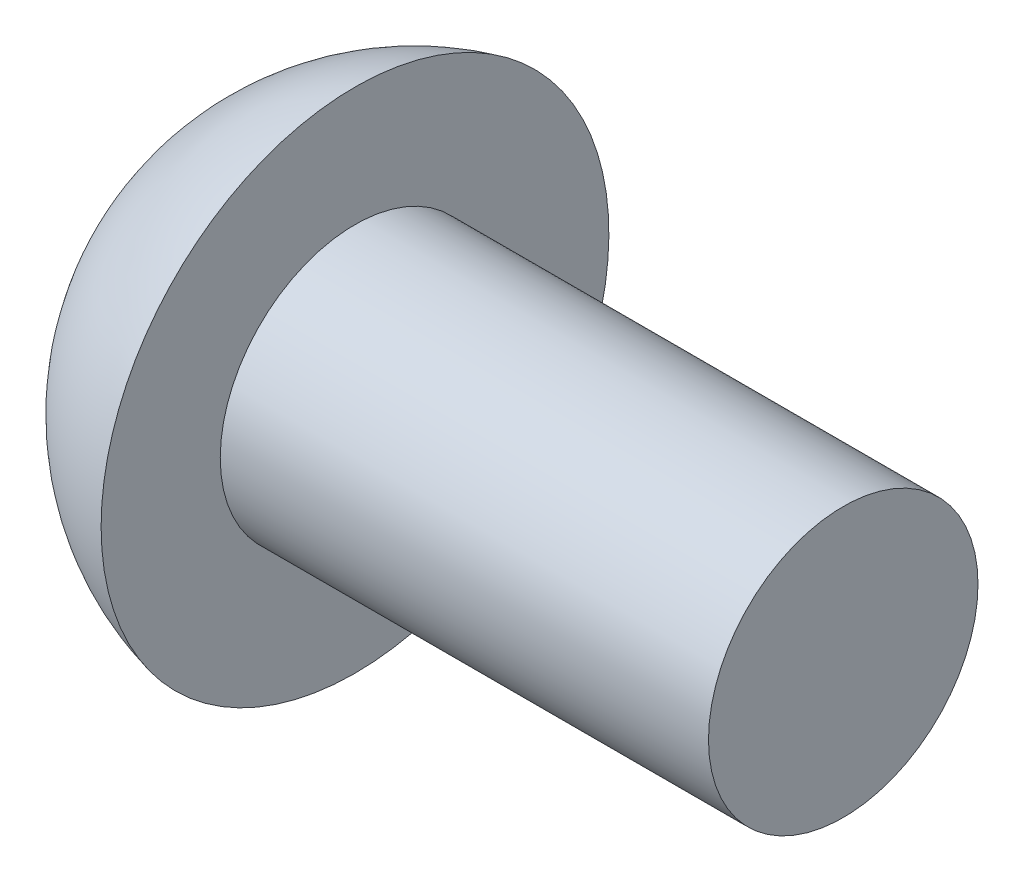
ISO-10303-21;
HEADER;
FILE_DESCRIPTION(('STEP AP214'),'2;1');
FILE_NAME('part.step','',(''),(''),'','','');
FILE_SCHEMA(('AUTOMOTIVE_DESIGN { 1 0 10303 214 1 1 1 1 }'));
ENDSEC;
DATA;
#1=APPLICATION_CONTEXT('core data for automotive mechanical design processes');
#2=APPLICATION_PROTOCOL_DEFINITION('international standard','automotive_design',2000,#1);
#3=PRODUCT_CONTEXT('',#1,'mechanical');
#4=PRODUCT('Part','Part','',(#3));
#5=PRODUCT_RELATED_PRODUCT_CATEGORY('part','',(#4));
#6=PRODUCT_DEFINITION_FORMATION('','',#4);
#7=PRODUCT_DEFINITION_CONTEXT('part definition',#1,'design');
#8=PRODUCT_DEFINITION('design','',#6,#7);
#9=PRODUCT_DEFINITION_SHAPE('','',#8);
#10=(LENGTH_UNIT() NAMED_UNIT(*) SI_UNIT(.MILLI.,.METRE.));
#11=(NAMED_UNIT(*) PLANE_ANGLE_UNIT() SI_UNIT($,.RADIAN.));
#12=(NAMED_UNIT(*) SI_UNIT($,.STERADIAN.) SOLID_ANGLE_UNIT());
#13=UNCERTAINTY_MEASURE_WITH_UNIT(LENGTH_MEASURE(1.E-05),#10,'distance_accuracy_value','');
#14=(GEOMETRIC_REPRESENTATION_CONTEXT(3) GLOBAL_UNCERTAINTY_ASSIGNED_CONTEXT((#13)) GLOBAL_UNIT_ASSIGNED_CONTEXT((#10,
#11,#12)) REPRESENTATION_CONTEXT('',''));
#15=CARTESIAN_POINT('',(0.,0.,0.));
#16=DIRECTION('',(0.,0.,1.));
#17=DIRECTION('',(1.,0.,0.));
#18=AXIS2_PLACEMENT_3D('',#15,#16,#17);
#19=CARTESIAN_POINT('',(3.391886407767,0.,0.));
#20=DIRECTION('',(-1.,0.,0.));
#21=DIRECTION('',(0.,1.,0.));
#22=AXIS2_PLACEMENT_3D('',#19,#20,#21);
#23=SPHERICAL_SURFACE('',#22,3.391886407767);
#24=CARTESIAN_POINT('',(2.6162,0.,0.));
#25=DIRECTION('',(-1.,0.,0.));
#26=DIRECTION('',(0.,0.,1.));
#27=AXIS2_PLACEMENT_3D('',#24,#25,#26);
#28=CIRCLE('',#27,3.302);
#29=CARTESIAN_POINT('',(2.6162,0.,3.302));
#30=VERTEX_POINT('',#29);
#31=EDGE_CURVE('E151',#30,#30,#28,.T.);
#32=ORIENTED_EDGE('',*,*,#31,.T.);
#33=EDGE_LOOP('',(#32));
#34=FACE_BOUND('',#33,.T.);
#35=CARTESIAN_POINT('',(3.40343702354918,0.,0.130454013539916));
#36=DIRECTION('',(-0.0881966272728716,0.,-0.996103084493613));
#37=DIRECTION('',(-0.996103084493613,0.,0.0881966272728716));
#38=AXIS2_PLACEMENT_3D('',#35,#36,#37);
#39=CIRCLE('',#38,3.38935712736515);
#40=CARTESIAN_POINT('',(0.508411631034494,1.74380745876436,0.386784386835487));
#41=VERTEX_POINT('',#40);
#42=CARTESIAN_POINT('',(0.0541878318263693,0.427002119057039,0.427002119057039));
#43=VERTEX_POINT('',#42);
#44=EDGE_CURVE('E122',#41,#43,#39,.F.);
#45=ORIENTED_EDGE('',*,*,#44,.T.);
#46=CARTESIAN_POINT('',(3.40343702354918,0.130454013539916,0.));
#47=DIRECTION('',(-0.088196627272872,-0.996103084493613,0.));
#48=DIRECTION('',(0.996103084493613,-0.088196627272872,0.));
#49=AXIS2_PLACEMENT_3D('',#46,#47,#48);
#50=CIRCLE('',#49,3.38935712736515);
#51=CARTESIAN_POINT('',(0.508411631034491,0.386784386835482,1.74380745876436));
#52=VERTEX_POINT('',#51);
#53=EDGE_CURVE('E104',#43,#52,#50,.F.);
#54=ORIENTED_EDGE('',*,*,#53,.T.);
#55=CARTESIAN_POINT('',(3.12960445130608,0.,-0.331303523950643));
#56=DIRECTION('',(0.620702944365561,0.,0.784045824461761));
#57=DIRECTION('',(0.784045824461762,0.,-0.620702944365561));
#58=AXIS2_PLACEMENT_3D('',#55,#56,#57);
#59=CIRCLE('',#58,3.36546275473782);
#60=CARTESIAN_POINT('',(0.50841163103449,-0.386784386835493,1.74380745876436));
#61=VERTEX_POINT('',#60);
#62=EDGE_CURVE('E115',#61,#52,#59,.F.);
#63=ORIENTED_EDGE('',*,*,#62,.F.);
#64=CARTESIAN_POINT('',(3.40343702354918,-0.130454013539917,0.));
#65=DIRECTION('',(-0.0881966272728716,0.996103084493613,0.));
#66=DIRECTION('',(-0.996103084493613,-0.0881966272728716,0.));
#67=AXIS2_PLACEMENT_3D('',#64,#65,#66);
#68=CIRCLE('',#67,3.38935712736515);
#69=CARTESIAN_POINT('',(0.0541878318263671,-0.427002119057041,0.427002119057039));
#70=VERTEX_POINT('',#69);
#71=EDGE_CURVE('E181',#61,#70,#68,.F.);
#72=ORIENTED_EDGE('',*,*,#71,.T.);
#73=CARTESIAN_POINT('',(0.508411631034487,-1.74380745876437,0.386784386835487));
#74=VERTEX_POINT('',#73);
#75=EDGE_CURVE('E156',#70,#74,#39,.F.);
#76=ORIENTED_EDGE('',*,*,#75,.T.);
#77=CARTESIAN_POINT('',(3.12960445130607,0.33130352395064,0.));
#78=DIRECTION('',(0.620702944365561,-0.784045824461761,0.));
#79=DIRECTION('',(0.784045824461762,0.620702944365561,0.));
#80=AXIS2_PLACEMENT_3D('',#77,#78,#79);
#81=CIRCLE('',#80,3.36546275473781);
#82=CARTESIAN_POINT('',(0.508411631034487,-1.74380745876437,-0.386784386835488));
#83=VERTEX_POINT('',#82);
#84=EDGE_CURVE('E154',#83,#74,#81,.F.);
#85=ORIENTED_EDGE('',*,*,#84,.F.);
#86=CARTESIAN_POINT('',(3.40343702354918,0.,-0.130454013539916));
#87=DIRECTION('',(-0.088196627272872,0.,0.996103084493613));
#88=DIRECTION('',(0.996103084493613,0.,0.088196627272872));
#89=AXIS2_PLACEMENT_3D('',#86,#87,#88);
#90=CIRCLE('',#89,3.38935712736515);
#91=CARTESIAN_POINT('',(0.0541878318263667,-0.427002119057038,-0.42700211905704));
#92=VERTEX_POINT('',#91);
#93=EDGE_CURVE('E158',#83,#92,#90,.F.);
#94=ORIENTED_EDGE('',*,*,#93,.T.);
#95=CARTESIAN_POINT('',(0.50841163103449,-0.386784386835481,-1.74380745876436));
#96=VERTEX_POINT('',#95);
#97=EDGE_CURVE('E185',#92,#96,#68,.F.);
#98=ORIENTED_EDGE('',*,*,#97,.T.);
#99=CARTESIAN_POINT('',(3.12960445130608,0.,0.331303523950643));
#100=DIRECTION('',(0.620702944365561,0.,-0.784045824461761));
#101=DIRECTION('',(-0.784045824461762,0.,-0.620702944365561));
#102=AXIS2_PLACEMENT_3D('',#99,#100,#101);
#103=CIRCLE('',#102,3.36546275473782);
#104=CARTESIAN_POINT('',(0.508411631034491,0.386784386835494,-1.74380745876436));
#105=VERTEX_POINT('',#104);
#106=EDGE_CURVE('E116',#105,#96,#103,.F.);
#107=ORIENTED_EDGE('',*,*,#106,.F.);
#108=CARTESIAN_POINT('',(0.0541878318263702,0.427002119057042,-0.42700211905704));
#109=VERTEX_POINT('',#108);
#110=EDGE_CURVE('E141',#105,#109,#50,.F.);
#111=ORIENTED_EDGE('',*,*,#110,.T.);
#112=CARTESIAN_POINT('',(0.508411631034494,1.74380745876436,-0.386784386835487));
#113=VERTEX_POINT('',#112);
#114=EDGE_CURVE('E55',#109,#113,#90,.F.);
#115=ORIENTED_EDGE('',*,*,#114,.T.);
#116=CARTESIAN_POINT('',(3.12960445130608,-0.331303523950647,0.));
#117=DIRECTION('',(0.620702944365561,0.784045824461761,0.));
#118=DIRECTION('',(-0.784045824461762,0.620702944365561,0.));
#119=AXIS2_PLACEMENT_3D('',#116,#117,#118);
#120=CIRCLE('',#119,3.36546275473782);
#121=EDGE_CURVE('E40',#41,#113,#120,.F.);
#122=ORIENTED_EDGE('',*,*,#121,.F.);
#123=EDGE_LOOP('',(#45,#54,#63,#72,#76,#85,#94,#98,#107,#111,#115,#122));
#124=FACE_BOUND('',#123,.T.);
#125=ADVANCED_FACE('F33',(#34,#124),#23,.T.);
#126=CARTESIAN_POINT('',(2.71111578947368,0.,-0.191753289473684));
#127=DIRECTION('',(-0.088196627272872,0.,0.996103084493613));
#128=DIRECTION('',(0.996103084493613,0.,0.088196627272872));
#129=AXIS2_PLACEMENT_3D('',#126,#127,#128);
#130=PLANE('',#129);
#131=ORIENTED_EDGE('',*,*,#114,.F.);
#132=DIRECTION('',(0.992251374627029,-0.0878555904617685,0.0878555904617682));
#133=VECTOR('',#132,1.);
#134=CARTESIAN_POINT('',(2.72783184996303,0.190273221617857,-0.190273221617857));
#135=LINE('',#134,#133);
#136=CARTESIAN_POINT('',(2.4384,0.215900000000001,-0.215899999999999));
#137=VERTEX_POINT('',#136);
#138=EDGE_CURVE('E163',#109,#137,#135,.T.);
#139=ORIENTED_EDGE('',*,*,#138,.T.);
#140=DIRECTION('',(0.782163374420786,-0.619212671416456,0.0692540487768405));
#141=VECTOR('',#140,1.);
#142=CARTESIAN_POINT('',(0.,2.1463,-0.4318));
#143=LINE('',#142,#141);
#144=EDGE_CURVE('E125',#113,#137,#143,.T.);
#145=ORIENTED_EDGE('',*,*,#144,.F.);
#146=EDGE_LOOP('',(#131,#139,#145));
#147=FACE_BOUND('',#146,.T.);
#148=ADVANCED_FACE('F162',(#147),#130,.T.);
#149=DIRECTION('',(0.782163374420786,0.619212671416456,0.0692540487768405));
#150=VECTOR('',#149,1.);
#151=CARTESIAN_POINT('',(0.,-2.1463,-0.4318));
#152=LINE('',#151,#150);
#153=CARTESIAN_POINT('',(2.4384,-0.2159,-0.2159));
#154=VERTEX_POINT('',#153);
#155=EDGE_CURVE('E47',#83,#154,#152,.T.);
#156=ORIENTED_EDGE('',*,*,#155,.T.);
#157=DIRECTION('',(-0.992251374627029,-0.0878555904617675,-0.0878555904617682));
#158=VECTOR('',#157,1.);
#159=CARTESIAN_POINT('',(2.72783184996303,-0.190273221617856,-0.190273221617857));
#160=LINE('',#159,#158);
#161=EDGE_CURVE('E183',#154,#92,#160,.T.);
#162=ORIENTED_EDGE('',*,*,#161,.T.);
#163=ORIENTED_EDGE('',*,*,#93,.F.);
#164=EDGE_LOOP('',(#156,#162,#163));
#165=FACE_BOUND('',#164,.T.);
#166=ADVANCED_FACE('F207',(#165),#130,.T.);
#167=CARTESIAN_POINT('',(2.71111578947368,0.,0.191753289473684));
#168=DIRECTION('',(-0.0881966272728716,0.,-0.996103084493613));
#169=DIRECTION('',(-0.996103084493613,0.,0.0881966272728716));
#170=AXIS2_PLACEMENT_3D('',#167,#168,#169);
#171=PLANE('',#170);
#172=DIRECTION('',(0.782163374420786,-0.619212671416456,-0.0692540487768402));
#173=VECTOR('',#172,1.);
#174=CARTESIAN_POINT('',(0.,2.1463,0.431799999999999));
#175=LINE('',#174,#173);
#176=CARTESIAN_POINT('',(2.4384,0.215899999999999,0.215900000000001));
#177=VERTEX_POINT('',#176);
#178=EDGE_CURVE('E120',#41,#177,#175,.T.);
#179=ORIENTED_EDGE('',*,*,#178,.T.);
#180=DIRECTION('',(-0.992251374627029,0.0878555904617679,0.0878555904617678));
#181=VECTOR('',#180,1.);
#182=CARTESIAN_POINT('',(2.72783184996303,0.190273221617856,0.190273221617857));
#183=LINE('',#182,#181);
#184=EDGE_CURVE('E11',#177,#43,#183,.T.);
#185=ORIENTED_EDGE('',*,*,#184,.T.);
#186=ORIENTED_EDGE('',*,*,#44,.F.);
#187=EDGE_LOOP('',(#179,#185,#186));
#188=FACE_BOUND('',#187,.T.);
#189=ADVANCED_FACE('F121',(#188),#171,.T.);
#190=ORIENTED_EDGE('',*,*,#75,.F.);
#191=DIRECTION('',(0.992251374627029,0.0878555904617681,-0.0878555904617678));
#192=VECTOR('',#191,1.);
#193=CARTESIAN_POINT('',(2.72783184996303,-0.190273221617857,0.190273221617857));
#194=LINE('',#193,#192);
#195=CARTESIAN_POINT('',(2.4384,-0.2159,0.2159));
#196=VERTEX_POINT('',#195);
#197=EDGE_CURVE('E178',#70,#196,#194,.T.);
#198=ORIENTED_EDGE('',*,*,#197,.T.);
#199=DIRECTION('',(0.782163374420786,0.619212671416456,-0.0692540487768401));
#200=VECTOR('',#199,1.);
#201=CARTESIAN_POINT('',(0.,-2.1463,0.431799999999999));
#202=LINE('',#201,#200);
#203=EDGE_CURVE('E169',#74,#196,#202,.T.);
#204=ORIENTED_EDGE('',*,*,#203,.F.);
#205=EDGE_LOOP('',(#190,#198,#204));
#206=FACE_BOUND('',#205,.T.);
#207=ADVANCED_FACE('F177',(#206),#171,.T.);
#208=CARTESIAN_POINT('',(2.6162,1.75259999999999,0.));
#209=DIRECTION('',(-1.,0.,0.));
#210=DIRECTION('',(0.,0.,1.));
#211=AXIS2_PLACEMENT_3D('',#208,#209,#210);
#212=PLANE('',#211);
#213=ORIENTED_EDGE('',*,*,#31,.F.);
#214=EDGE_LOOP('',(#213));
#215=FACE_BOUND('',#214,.T.);
#216=CARTESIAN_POINT('',(2.6162,0.,0.));
#217=DIRECTION('',(-1.,0.,0.));
#218=DIRECTION('',(0.,0.,1.));
#219=AXIS2_PLACEMENT_3D('',#216,#217,#218);
#220=CIRCLE('',#219,1.75259999999999);
#221=CARTESIAN_POINT('',(2.6162,0.,1.75259999999999));
#222=VERTEX_POINT('',#221);
#223=EDGE_CURVE('E148',#222,#222,#220,.T.);
#224=ORIENTED_EDGE('',*,*,#223,.T.);
#225=EDGE_LOOP('',(#224));
#226=FACE_BOUND('',#225,.T.);
#227=ADVANCED_FACE('F227',(#215,#226),#212,.F.);
#228=CARTESIAN_POINT('',(0.,0.,0.));
#229=DIRECTION('',(-1.,0.,0.));
#230=DIRECTION('',(0.,0.,1.));
#231=AXIS2_PLACEMENT_3D('',#228,#229,#230);
#232=CYLINDRICAL_SURFACE('',#231,1.75259999999999);
#233=ORIENTED_EDGE('',*,*,#223,.F.);
#234=EDGE_LOOP('',(#233));
#235=FACE_BOUND('',#234,.T.);
#236=CARTESIAN_POINT('',(8.96619999999999,0.,0.));
#237=DIRECTION('',(-1.,0.,0.));
#238=DIRECTION('',(0.,0.,1.));
#239=AXIS2_PLACEMENT_3D('',#236,#237,#238);
#240=CIRCLE('',#239,1.75259999999999);
#241=CARTESIAN_POINT('',(8.96619999999999,0.,1.75259999999999));
#242=VERTEX_POINT('',#241);
#243=EDGE_CURVE('E145',#242,#242,#240,.T.);
#244=ORIENTED_EDGE('',*,*,#243,.T.);
#245=EDGE_LOOP('',(#244));
#246=FACE_BOUND('',#245,.T.);
#247=ADVANCED_FACE('F230',(#235,#246),#232,.T.);
#248=CARTESIAN_POINT('',(8.96619999999999,0.,0.));
#249=DIRECTION('',(-1.,0.,0.));
#250=DIRECTION('',(0.,0.,1.));
#251=AXIS2_PLACEMENT_3D('',#248,#249,#250);
#252=PLANE('',#251);
#253=ORIENTED_EDGE('',*,*,#243,.F.);
#254=EDGE_LOOP('',(#253));
#255=FACE_BOUND('',#254,.T.);
#256=ADVANCED_FACE('F235',(#255),#252,.F.);
#257=CARTESIAN_POINT('',(2.4384,0.2159,-0.2159));
#258=DIRECTION('',(-1.,0.,0.));
#259=DIRECTION('',(0.,0.,1.));
#260=AXIS2_PLACEMENT_3D('',#257,#258,#259);
#261=PLANE('',#260);
#262=DIRECTION('',(0.,1.,0.));
#263=VECTOR('',#262,1.);
#264=CARTESIAN_POINT('',(2.4384,-0.2159,-0.2159));
#265=LINE('',#264,#263);
#266=EDGE_CURVE('E138',#154,#137,#265,.T.);
#267=ORIENTED_EDGE('',*,*,#266,.F.);
#268=DIRECTION('',(0.,0.,1.));
#269=VECTOR('',#268,1.);
#270=CARTESIAN_POINT('',(2.4384,-0.2159,-0.2159));
#271=LINE('',#270,#269);
#272=EDGE_CURVE('E133',#154,#196,#271,.T.);
#273=ORIENTED_EDGE('',*,*,#272,.T.);
#274=DIRECTION('',(0.,-1.,0.));
#275=VECTOR('',#274,1.);
#276=CARTESIAN_POINT('',(2.4384,0.2159,0.2159));
#277=LINE('',#276,#275);
#278=EDGE_CURVE('E112',#177,#196,#277,.T.);
#279=ORIENTED_EDGE('',*,*,#278,.F.);
#280=DIRECTION('',(0.,0.,-1.));
#281=VECTOR('',#280,1.);
#282=CARTESIAN_POINT('',(2.4384,0.2159,0.2159));
#283=LINE('',#282,#281);
#284=EDGE_CURVE('E132',#177,#137,#283,.T.);
#285=ORIENTED_EDGE('',*,*,#284,.T.);
#286=EDGE_LOOP('',(#267,#273,#279,#285));
#287=FACE_BOUND('',#286,.T.);
#288=ADVANCED_FACE('F131',(#287),#261,.T.);
#289=CARTESIAN_POINT('',(2.4384,0.2159,0.2159));
#290=DIRECTION('',(0.620702944365561,0.784045824461761,0.));
#291=DIRECTION('',(-0.784045824461762,0.620702944365561,0.));
#292=AXIS2_PLACEMENT_3D('',#289,#290,#291);
#293=PLANE('',#292);
#294=ORIENTED_EDGE('',*,*,#121,.T.);
#295=ORIENTED_EDGE('',*,*,#144,.T.);
#296=ORIENTED_EDGE('',*,*,#284,.F.);
#297=ORIENTED_EDGE('',*,*,#178,.F.);
#298=EDGE_LOOP('',(#294,#295,#296,#297));
#299=FACE_BOUND('',#298,.T.);
#300=ADVANCED_FACE('F136',(#299),#293,.F.);
#301=CARTESIAN_POINT('',(2.4384,-0.2159,-0.2159));
#302=DIRECTION('',(0.620702944365561,-0.784045824461761,0.));
#303=DIRECTION('',(0.784045824461762,0.620702944365561,0.));
#304=AXIS2_PLACEMENT_3D('',#301,#302,#303);
#305=PLANE('',#304);
#306=ORIENTED_EDGE('',*,*,#84,.T.);
#307=ORIENTED_EDGE('',*,*,#203,.T.);
#308=ORIENTED_EDGE('',*,*,#272,.F.);
#309=ORIENTED_EDGE('',*,*,#155,.F.);
#310=EDGE_LOOP('',(#306,#307,#308,#309));
#311=FACE_BOUND('',#310,.T.);
#312=ADVANCED_FACE('F172',(#311),#305,.F.);
#313=CARTESIAN_POINT('',(2.71111578947368,0.191753289473684,0.));
#314=DIRECTION('',(-0.088196627272872,-0.996103084493613,0.));
#315=DIRECTION('',(0.996103084493613,-0.088196627272872,0.));
#316=AXIS2_PLACEMENT_3D('',#313,#314,#315);
#317=PLANE('',#316);
#318=ORIENTED_EDGE('',*,*,#184,.F.);
#319=DIRECTION('',(0.782163374420786,-0.0692540487768383,-0.619212671416456));
#320=VECTOR('',#319,1.);
#321=CARTESIAN_POINT('',(0.,0.431799999999993,2.1463));
#322=LINE('',#321,#320);
#323=EDGE_CURVE('E102',#52,#177,#322,.T.);
#324=ORIENTED_EDGE('',*,*,#323,.F.);
#325=ORIENTED_EDGE('',*,*,#53,.F.);
#326=EDGE_LOOP('',(#318,#324,#325));
#327=FACE_BOUND('',#326,.T.);
#328=ADVANCED_FACE('F101',(#327),#317,.T.);
#329=CARTESIAN_POINT('',(2.71111578947368,-0.191753289473684,0.));
#330=DIRECTION('',(-0.0881966272728716,0.996103084493613,0.));
#331=DIRECTION('',(-0.996103084493613,-0.0881966272728716,0.));
#332=AXIS2_PLACEMENT_3D('',#329,#330,#331);
#333=PLANE('',#332);
#334=DIRECTION('',(0.782163374420786,0.0692540487768424,-0.619212671416456));
#335=VECTOR('',#334,1.);
#336=CARTESIAN_POINT('',(0.,-0.431800000000007,2.1463));
#337=LINE('',#336,#335);
#338=EDGE_CURVE('E117',#61,#196,#337,.T.);
#339=ORIENTED_EDGE('',*,*,#338,.T.);
#340=ORIENTED_EDGE('',*,*,#197,.F.);
#341=ORIENTED_EDGE('',*,*,#71,.F.);
#342=EDGE_LOOP('',(#339,#340,#341));
#343=FACE_BOUND('',#342,.T.);
#344=ADVANCED_FACE('F208',(#343),#333,.T.);
#345=CARTESIAN_POINT('',(2.4384,-0.215900000000001,0.215899999999999));
#346=DIRECTION('',(0.620702944365561,0.,0.784045824461761));
#347=DIRECTION('',(-0.784045824461762,0.,0.620702944365561));
#348=AXIS2_PLACEMENT_3D('',#345,#346,#347);
#349=PLANE('',#348);
#350=ORIENTED_EDGE('',*,*,#62,.T.);
#351=ORIENTED_EDGE('',*,*,#323,.T.);
#352=ORIENTED_EDGE('',*,*,#278,.T.);
#353=ORIENTED_EDGE('',*,*,#338,.F.);
#354=EDGE_LOOP('',(#350,#351,#352,#353));
#355=FACE_BOUND('',#354,.T.);
#356=ADVANCED_FACE('F109',(#355),#349,.F.);
#357=DIRECTION('',(0.782163374420786,-0.0692540487768426,0.619212671416456));
#358=VECTOR('',#357,1.);
#359=CARTESIAN_POINT('',(0.,0.431800000000008,-2.1463));
#360=LINE('',#359,#358);
#361=EDGE_CURVE('E196',#105,#137,#360,.T.);
#362=ORIENTED_EDGE('',*,*,#361,.T.);
#363=ORIENTED_EDGE('',*,*,#138,.F.);
#364=ORIENTED_EDGE('',*,*,#110,.F.);
#365=EDGE_LOOP('',(#362,#363,#364));
#366=FACE_BOUND('',#365,.T.);
#367=ADVANCED_FACE('F195',(#366),#317,.T.);
#368=ORIENTED_EDGE('',*,*,#161,.F.);
#369=DIRECTION('',(0.782163374420786,0.0692540487768379,0.619212671416456));
#370=VECTOR('',#369,1.);
#371=CARTESIAN_POINT('',(0.,-0.431799999999991,-2.1463));
#372=LINE('',#371,#370);
#373=EDGE_CURVE('E200',#96,#154,#372,.T.);
#374=ORIENTED_EDGE('',*,*,#373,.F.);
#375=ORIENTED_EDGE('',*,*,#97,.F.);
#376=EDGE_LOOP('',(#368,#374,#375));
#377=FACE_BOUND('',#376,.T.);
#378=ADVANCED_FACE('F205',(#377),#333,.T.);
#379=CARTESIAN_POINT('',(2.4384,0.215900000000001,-0.215899999999999));
#380=DIRECTION('',(0.620702944365561,0.,-0.784045824461761));
#381=DIRECTION('',(0.784045824461762,0.,0.620702944365561));
#382=AXIS2_PLACEMENT_3D('',#379,#380,#381);
#383=PLANE('',#382);
#384=ORIENTED_EDGE('',*,*,#106,.T.);
#385=ORIENTED_EDGE('',*,*,#373,.T.);
#386=ORIENTED_EDGE('',*,*,#266,.T.);
#387=ORIENTED_EDGE('',*,*,#361,.F.);
#388=EDGE_LOOP('',(#384,#385,#386,#387));
#389=FACE_BOUND('',#388,.T.);
#390=ADVANCED_FACE('F198',(#389),#383,.F.);
#391=CLOSED_SHELL('',(#125,#148,#166,#189,#207,#227,#247,#256,#288,#300,#312,#328,#344,#356,
#367,#378,#390));
#392=MANIFOLD_SOLID_BREP('B2',#391);
#393=ADVANCED_BREP_SHAPE_REPRESENTATION('',(#18,#392),#14);
#394=SHAPE_DEFINITION_REPRESENTATION(#9,#393);
ENDSEC;
END-ISO-10303-21;
